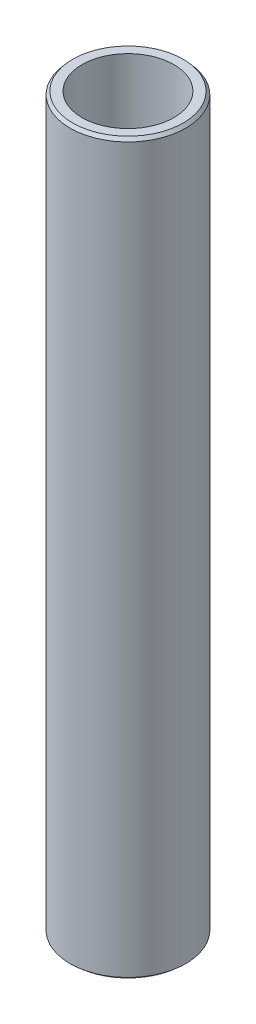
ISO-10303-21;
HEADER;
FILE_DESCRIPTION(('STEP AP214'),'2;1');
FILE_NAME('part.step','',(''),(''),'','','');
FILE_SCHEMA(('AUTOMOTIVE_DESIGN { 1 0 10303 214 1 1 1 1 }'));
ENDSEC;
DATA;
#1=APPLICATION_CONTEXT('core data for automotive mechanical design processes');
#2=APPLICATION_PROTOCOL_DEFINITION('international standard','automotive_design',2000,#1);
#3=PRODUCT_CONTEXT('',#1,'mechanical');
#4=PRODUCT('Part','Part','',(#3));
#5=PRODUCT_RELATED_PRODUCT_CATEGORY('part','',(#4));
#6=PRODUCT_DEFINITION_FORMATION('','',#4);
#7=PRODUCT_DEFINITION_CONTEXT('part definition',#1,'design');
#8=PRODUCT_DEFINITION('design','',#6,#7);
#9=PRODUCT_DEFINITION_SHAPE('','',#8);
#10=(LENGTH_UNIT() NAMED_UNIT(*) SI_UNIT(.MILLI.,.METRE.));
#11=(NAMED_UNIT(*) PLANE_ANGLE_UNIT() SI_UNIT($,.RADIAN.));
#12=(NAMED_UNIT(*) SI_UNIT($,.STERADIAN.) SOLID_ANGLE_UNIT());
#13=UNCERTAINTY_MEASURE_WITH_UNIT(LENGTH_MEASURE(1.E-05),#10,'distance_accuracy_value','');
#14=(GEOMETRIC_REPRESENTATION_CONTEXT(3) GLOBAL_UNCERTAINTY_ASSIGNED_CONTEXT((#13)) GLOBAL_UNIT_ASSIGNED_CONTEXT((#10,
#11,#12)) REPRESENTATION_CONTEXT('',''));
#15=CARTESIAN_POINT('',(0.,0.,0.));
#16=DIRECTION('',(0.,0.,1.));
#17=DIRECTION('',(1.,0.,0.));
#18=AXIS2_PLACEMENT_3D('',#15,#16,#17);
#19=CARTESIAN_POINT('',(0.,503.659228782313,0.));
#20=DIRECTION('',(0.,-1.,0.));
#21=DIRECTION('',(0.,0.,-1.));
#22=AXIS2_PLACEMENT_3D('',#19,#20,#21);
#23=CYLINDRICAL_SURFACE('',#22,40.);
#24=CARTESIAN_POINT('',(0.,501.515592786014,0.));
#25=DIRECTION('',(0.,1.,0.));
#26=DIRECTION('',(0.,0.,1.));
#27=AXIS2_PLACEMENT_3D('',#24,#25,#26);
#28=CIRCLE('',#27,40.);
#29=CARTESIAN_POINT('',(0.,501.515592786014,40.));
#30=VERTEX_POINT('',#29);
#31=EDGE_CURVE('E50',#30,#30,#28,.F.);
#32=ORIENTED_EDGE('',*,*,#31,.T.);
#33=EDGE_LOOP('',(#32));
#34=FACE_BOUND('',#33,.T.);
#35=CARTESIAN_POINT('',(0.,1.84366508538958,0.));
#36=DIRECTION('',(0.,1.,0.));
#37=DIRECTION('',(0.,0.,1.));
#38=AXIS2_PLACEMENT_3D('',#35,#36,#37);
#39=CIRCLE('',#38,40.);
#40=CARTESIAN_POINT('',(0.,1.84366508538958,40.));
#41=VERTEX_POINT('',#40);
#42=EDGE_CURVE('E51',#41,#41,#39,.T.);
#43=ORIENTED_EDGE('',*,*,#42,.T.);
#44=EDGE_LOOP('',(#43));
#45=FACE_BOUND('',#44,.T.);
#46=ADVANCED_FACE('F39',(#34,#45),#23,.T.);
#47=CARTESIAN_POINT('',(0.,503.659228782313,0.));
#48=DIRECTION('',(0.,1.,0.));
#49=DIRECTION('',(0.,0.,1.));
#50=AXIS2_PLACEMENT_3D('',#47,#48,#49);
#51=PLANE('',#50);
#52=CARTESIAN_POINT('',(0.,503.659228782313,0.));
#53=DIRECTION('',(0.,1.,0.));
#54=DIRECTION('',(0.,0.,1.));
#55=AXIS2_PLACEMENT_3D('',#52,#53,#54);
#56=CIRCLE('',#55,38.1563349146104);
#57=CARTESIAN_POINT('',(0.,503.659228782313,38.1563349146104));
#58=VERTEX_POINT('',#57);
#59=EDGE_CURVE('E54',#58,#58,#56,.T.);
#60=ORIENTED_EDGE('',*,*,#59,.T.);
#61=EDGE_LOOP('',(#60));
#62=FACE_BOUND('',#61,.T.);
#63=CARTESIAN_POINT('',(0.,503.659228782313,0.));
#64=DIRECTION('',(0.,1.,0.));
#65=DIRECTION('',(0.,0.,1.));
#66=AXIS2_PLACEMENT_3D('',#63,#64,#65);
#67=CIRCLE('',#66,31.7389298508101);
#68=CARTESIAN_POINT('',(0.,503.659228782313,31.7389298508101));
#69=VERTEX_POINT('',#68);
#70=EDGE_CURVE('E58',#69,#69,#67,.T.);
#71=ORIENTED_EDGE('',*,*,#70,.F.);
#72=EDGE_LOOP('',(#71));
#73=FACE_BOUND('',#72,.T.);
#74=ADVANCED_FACE('F69',(#62,#73),#51,.T.);
#75=CARTESIAN_POINT('',(0.,0.,0.));
#76=DIRECTION('',(0.,1.,0.));
#77=DIRECTION('',(0.,0.,1.));
#78=AXIS2_PLACEMENT_3D('',#75,#76,#77);
#79=PLANE('',#78);
#80=CARTESIAN_POINT('',(0.,0.,0.));
#81=DIRECTION('',(0.,1.,0.));
#82=DIRECTION('',(0.,0.,1.));
#83=AXIS2_PLACEMENT_3D('',#80,#81,#82);
#84=CIRCLE('',#83,37.8563640037005);
#85=CARTESIAN_POINT('',(0.,0.,37.8563640037005));
#86=VERTEX_POINT('',#85);
#87=EDGE_CURVE('E10',#86,#86,#84,.F.);
#88=ORIENTED_EDGE('',*,*,#87,.T.);
#89=EDGE_LOOP('',(#88));
#90=FACE_BOUND('',#89,.T.);
#91=CARTESIAN_POINT('',(0.,0.,0.));
#92=DIRECTION('',(0.,1.,0.));
#93=DIRECTION('',(0.,0.,1.));
#94=AXIS2_PLACEMENT_3D('',#91,#92,#93);
#95=CIRCLE('',#94,31.7389298508101);
#96=CARTESIAN_POINT('',(0.,0.,31.7389298508101));
#97=VERTEX_POINT('',#96);
#98=EDGE_CURVE('E63',#97,#97,#95,.T.);
#99=ORIENTED_EDGE('',*,*,#98,.T.);
#100=EDGE_LOOP('',(#99));
#101=FACE_BOUND('',#100,.T.);
#102=ADVANCED_FACE('F75',(#90,#101),#79,.F.);
#103=CARTESIAN_POINT('',(0.,503.659228782313,0.));
#104=DIRECTION('',(0.,-1.,0.));
#105=DIRECTION('',(0.,0.,-1.));
#106=AXIS2_PLACEMENT_3D('',#103,#104,#105);
#107=CYLINDRICAL_SURFACE('',#106,31.7389298508101);
#108=ORIENTED_EDGE('',*,*,#70,.T.);
#109=EDGE_LOOP('',(#108));
#110=FACE_BOUND('',#109,.T.);
#111=ORIENTED_EDGE('',*,*,#98,.F.);
#112=EDGE_LOOP('',(#111));
#113=FACE_BOUND('',#112,.T.);
#114=ADVANCED_FACE('F70',(#110,#113),#107,.F.);
#115=CARTESIAN_POINT('',(0.,503.659228782313,0.));
#116=DIRECTION('',(0.,-1.,0.));
#117=DIRECTION('',(0.,0.,-1.));
#118=AXIS2_PLACEMENT_3D('',#115,#116,#117);
#119=CONICAL_SURFACE('',#118,38.1563349146104,0.710308047339106);
#120=ORIENTED_EDGE('',*,*,#31,.F.);
#121=EDGE_LOOP('',(#120));
#122=FACE_BOUND('',#121,.T.);
#123=ORIENTED_EDGE('',*,*,#59,.F.);
#124=EDGE_LOOP('',(#123));
#125=FACE_BOUND('',#124,.T.);
#126=ADVANCED_FACE('F81',(#122,#125),#119,.T.);
#127=CARTESIAN_POINT('',(0.,1.84366508538958,0.));
#128=DIRECTION('',(0.,1.,0.));
#129=DIRECTION('',(0.,0.,1.));
#130=AXIS2_PLACEMENT_3D('',#127,#128,#129);
#131=CONICAL_SURFACE('',#130,40.,0.860488279455814);
#132=ORIENTED_EDGE('',*,*,#87,.F.);
#133=EDGE_LOOP('',(#132));
#134=FACE_BOUND('',#133,.T.);
#135=ORIENTED_EDGE('',*,*,#42,.F.);
#136=EDGE_LOOP('',(#135));
#137=FACE_BOUND('',#136,.T.);
#138=ADVANCED_FACE('F45',(#134,#137),#131,.T.);
#139=CLOSED_SHELL('',(#46,#74,#102,#114,#126,#138));
#140=MANIFOLD_SOLID_BREP('B2',#139);
#141=ADVANCED_BREP_SHAPE_REPRESENTATION('',(#18,#140),#14);
#142=SHAPE_DEFINITION_REPRESENTATION(#9,#141);
ENDSEC;
END-ISO-10303-21;
